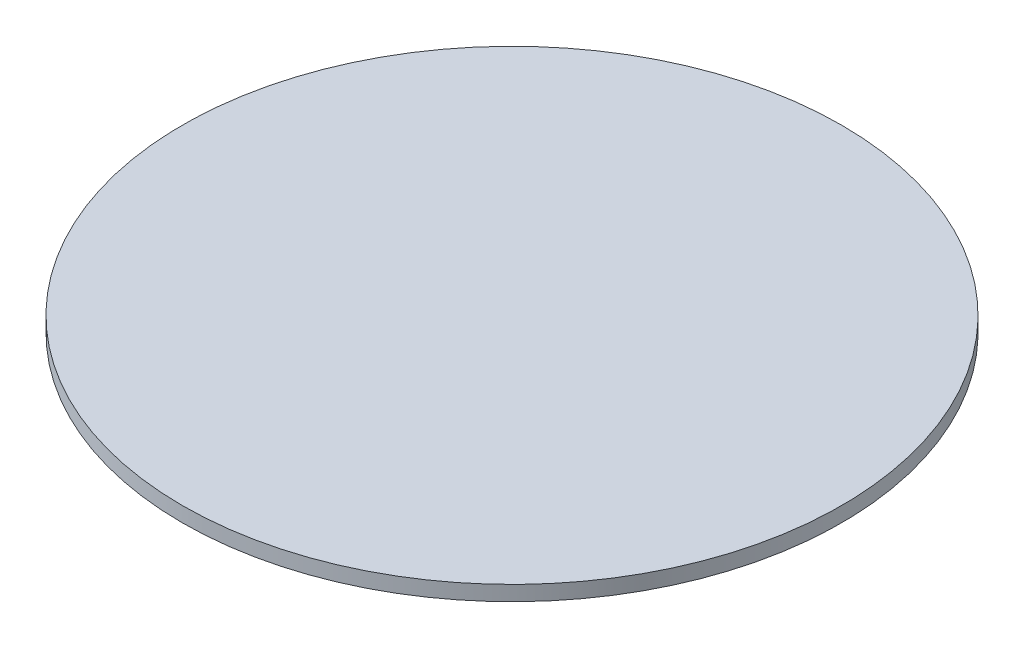
ISO-10303-21;
HEADER;
FILE_DESCRIPTION(('STEP AP214'),'2;1');
FILE_NAME('part.step','',(''),(''),'','','');
FILE_SCHEMA(('AUTOMOTIVE_DESIGN { 1 0 10303 214 1 1 1 1 }'));
ENDSEC;
DATA;
#1=APPLICATION_CONTEXT('core data for automotive mechanical design processes');
#2=APPLICATION_PROTOCOL_DEFINITION('international standard','automotive_design',2000,#1);
#3=PRODUCT_CONTEXT('',#1,'mechanical');
#4=PRODUCT('Part','Part','',(#3));
#5=PRODUCT_RELATED_PRODUCT_CATEGORY('part','',(#4));
#6=PRODUCT_DEFINITION_FORMATION('','',#4);
#7=PRODUCT_DEFINITION_CONTEXT('part definition',#1,'design');
#8=PRODUCT_DEFINITION('design','',#6,#7);
#9=PRODUCT_DEFINITION_SHAPE('','',#8);
#10=(LENGTH_UNIT() NAMED_UNIT(*) SI_UNIT(.MILLI.,.METRE.));
#11=(NAMED_UNIT(*) PLANE_ANGLE_UNIT() SI_UNIT($,.RADIAN.));
#12=(NAMED_UNIT(*) SI_UNIT($,.STERADIAN.) SOLID_ANGLE_UNIT());
#13=UNCERTAINTY_MEASURE_WITH_UNIT(LENGTH_MEASURE(1.E-05),#10,'distance_accuracy_value','');
#14=(GEOMETRIC_REPRESENTATION_CONTEXT(3) GLOBAL_UNCERTAINTY_ASSIGNED_CONTEXT((#13)) GLOBAL_UNIT_ASSIGNED_CONTEXT((#10,
#11,#12)) REPRESENTATION_CONTEXT('',''));
#15=CARTESIAN_POINT('',(0.,0.,0.));
#16=DIRECTION('',(0.,0.,1.));
#17=DIRECTION('',(1.,0.,0.));
#18=AXIS2_PLACEMENT_3D('',#15,#16,#17);
#19=CARTESIAN_POINT('',(0.,3.175,0.));
#20=DIRECTION('',(0.,-1.,0.));
#21=DIRECTION('',(0.,0.,-1.));
#22=AXIS2_PLACEMENT_3D('',#19,#20,#21);
#23=CYLINDRICAL_SURFACE('',#22,69.85);
#24=CARTESIAN_POINT('',(0.,3.175,0.));
#25=DIRECTION('',(0.,1.,0.));
#26=DIRECTION('',(0.,0.,1.));
#27=AXIS2_PLACEMENT_3D('',#24,#25,#26);
#28=CIRCLE('',#27,69.85);
#29=CARTESIAN_POINT('',(0.,3.175,69.85));
#30=VERTEX_POINT('',#29);
#31=EDGE_CURVE('E10',#30,#30,#28,.T.);
#32=ORIENTED_EDGE('',*,*,#31,.F.);
#33=EDGE_LOOP('',(#32));
#34=FACE_BOUND('',#33,.T.);
#35=CARTESIAN_POINT('',(0.,0.,0.));
#36=DIRECTION('',(0.,1.,0.));
#37=DIRECTION('',(0.,0.,1.));
#38=AXIS2_PLACEMENT_3D('',#35,#36,#37);
#39=CIRCLE('',#38,69.85);
#40=CARTESIAN_POINT('',(0.,0.,69.85));
#41=VERTEX_POINT('',#40);
#42=EDGE_CURVE('E34',#41,#41,#39,.T.);
#43=ORIENTED_EDGE('',*,*,#42,.T.);
#44=EDGE_LOOP('',(#43));
#45=FACE_BOUND('',#44,.T.);
#46=ADVANCED_FACE('F31',(#34,#45),#23,.T.);
#47=CARTESIAN_POINT('',(0.,3.175,0.));
#48=DIRECTION('',(0.,1.,0.));
#49=DIRECTION('',(0.,0.,1.));
#50=AXIS2_PLACEMENT_3D('',#47,#48,#49);
#51=PLANE('',#50);
#52=ORIENTED_EDGE('',*,*,#31,.T.);
#53=EDGE_LOOP('',(#52));
#54=FACE_BOUND('',#53,.T.);
#55=ADVANCED_FACE('F46',(#54),#51,.T.);
#56=CARTESIAN_POINT('',(0.,0.,0.));
#57=DIRECTION('',(0.,1.,0.));
#58=DIRECTION('',(0.,0.,1.));
#59=AXIS2_PLACEMENT_3D('',#56,#57,#58);
#60=PLANE('',#59);
#61=ORIENTED_EDGE('',*,*,#42,.F.);
#62=EDGE_LOOP('',(#61));
#63=FACE_BOUND('',#62,.T.);
#64=ADVANCED_FACE('F44',(#63),#60,.F.);
#65=CLOSED_SHELL('',(#46,#55,#64));
#66=MANIFOLD_SOLID_BREP('B2',#65);
#67=ADVANCED_BREP_SHAPE_REPRESENTATION('',(#18,#66),#14);
#68=SHAPE_DEFINITION_REPRESENTATION(#9,#67);
ENDSEC;
END-ISO-10303-21;
